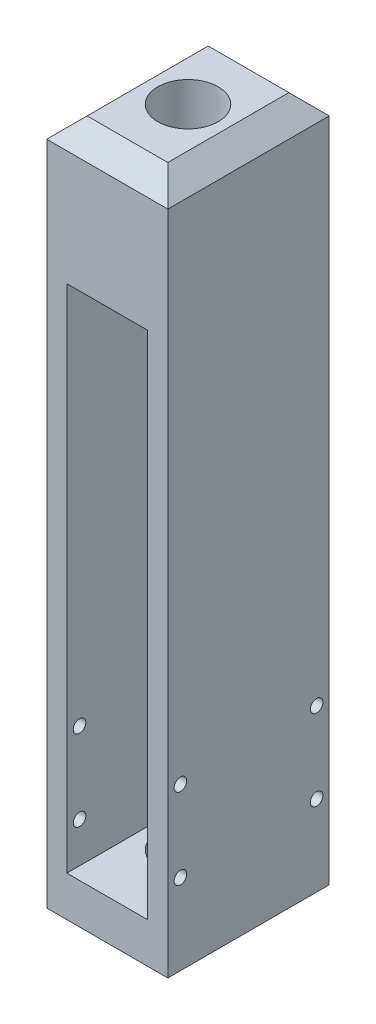
ISO-10303-21;
HEADER;
FILE_DESCRIPTION(('STEP AP214'),'2;1');
FILE_NAME('part.step','',(''),(''),'','','');
FILE_SCHEMA(('AUTOMOTIVE_DESIGN { 1 0 10303 214 1 1 1 1 }'));
ENDSEC;
DATA;
#1=APPLICATION_CONTEXT('core data for automotive mechanical design processes');
#2=APPLICATION_PROTOCOL_DEFINITION('international standard','automotive_design',2000,#1);
#3=PRODUCT_CONTEXT('',#1,'mechanical');
#4=PRODUCT('Part','Part','',(#3));
#5=PRODUCT_RELATED_PRODUCT_CATEGORY('part','',(#4));
#6=PRODUCT_DEFINITION_FORMATION('','',#4);
#7=PRODUCT_DEFINITION_CONTEXT('part definition',#1,'design');
#8=PRODUCT_DEFINITION('design','',#6,#7);
#9=PRODUCT_DEFINITION_SHAPE('','',#8);
#10=(LENGTH_UNIT() NAMED_UNIT(*) SI_UNIT(.MILLI.,.METRE.));
#11=(NAMED_UNIT(*) PLANE_ANGLE_UNIT() SI_UNIT($,.RADIAN.));
#12=(NAMED_UNIT(*) SI_UNIT($,.STERADIAN.) SOLID_ANGLE_UNIT());
#13=UNCERTAINTY_MEASURE_WITH_UNIT(LENGTH_MEASURE(1.E-05),#10,'distance_accuracy_value','');
#14=(GEOMETRIC_REPRESENTATION_CONTEXT(3) GLOBAL_UNCERTAINTY_ASSIGNED_CONTEXT((#13)) GLOBAL_UNIT_ASSIGNED_CONTEXT((#10,
#11,#12)) REPRESENTATION_CONTEXT('',''));
#15=CARTESIAN_POINT('',(0.,0.,0.));
#16=DIRECTION('',(0.,0.,1.));
#17=DIRECTION('',(1.,0.,0.));
#18=AXIS2_PLACEMENT_3D('',#15,#16,#17);
#19=CARTESIAN_POINT('',(38.1,0.,50.8));
#20=DIRECTION('',(-1.,0.,0.));
#21=DIRECTION('',(0.,0.,1.));
#22=AXIS2_PLACEMENT_3D('',#19,#20,#21);
#23=PLANE('',#22);
#24=CARTESIAN_POINT('',(38.1,25.4,3.96875));
#25=DIRECTION('',(1.,0.,0.));
#26=DIRECTION('',(0.,0.,-1.));
#27=AXIS2_PLACEMENT_3D('',#24,#25,#26);
#28=CIRCLE('',#27,1.984375);
#29=CARTESIAN_POINT('',(38.1,25.4,1.984375));
#30=VERTEX_POINT('',#29);
#31=EDGE_CURVE('E234',#30,#30,#28,.T.);
#32=ORIENTED_EDGE('',*,*,#31,.F.);
#33=EDGE_LOOP('',(#32));
#34=FACE_BOUND('',#33,.T.);
#35=CARTESIAN_POINT('',(38.1,50.8,3.96875));
#36=DIRECTION('',(1.,0.,0.));
#37=DIRECTION('',(0.,0.,-1.));
#38=AXIS2_PLACEMENT_3D('',#35,#36,#37);
#39=CIRCLE('',#38,1.984375);
#40=CARTESIAN_POINT('',(38.1,50.8,1.984375));
#41=VERTEX_POINT('',#40);
#42=EDGE_CURVE('E240',#41,#41,#39,.T.);
#43=ORIENTED_EDGE('',*,*,#42,.F.);
#44=EDGE_LOOP('',(#43));
#45=FACE_BOUND('',#44,.T.);
#46=CARTESIAN_POINT('',(38.1,50.8,46.83125));
#47=DIRECTION('',(1.,0.,0.));
#48=DIRECTION('',(0.,0.,-1.));
#49=AXIS2_PLACEMENT_3D('',#46,#47,#48);
#50=CIRCLE('',#49,1.984375);
#51=CARTESIAN_POINT('',(38.1,50.8,44.846875));
#52=VERTEX_POINT('',#51);
#53=EDGE_CURVE('E246',#52,#52,#50,.T.);
#54=ORIENTED_EDGE('',*,*,#53,.F.);
#55=EDGE_LOOP('',(#54));
#56=FACE_BOUND('',#55,.T.);
#57=DIRECTION('',(0.,1.,0.));
#58=VECTOR('',#57,1.);
#59=CARTESIAN_POINT('',(38.1,0.,0.));
#60=LINE('',#59,#58);
#61=CARTESIAN_POINT('',(38.1,0.,0.));
#62=VERTEX_POINT('',#61);
#63=CARTESIAN_POINT('',(38.1,209.55,0.));
#64=VERTEX_POINT('',#63);
#65=EDGE_CURVE('E159',#62,#64,#60,.T.);
#66=ORIENTED_EDGE('',*,*,#65,.T.);
#67=DIRECTION('',(0.,0.,1.));
#68=VECTOR('',#67,1.);
#69=CARTESIAN_POINT('',(38.1,209.55,50.8));
#70=LINE('',#69,#68);
#71=CARTESIAN_POINT('',(38.1,209.55,50.8));
#72=VERTEX_POINT('',#71);
#73=EDGE_CURVE('E42',#64,#72,#70,.T.);
#74=ORIENTED_EDGE('',*,*,#73,.T.);
#75=DIRECTION('',(0.,1.,0.));
#76=VECTOR('',#75,1.);
#77=CARTESIAN_POINT('',(38.1,0.,50.8));
#78=LINE('',#77,#76);
#79=CARTESIAN_POINT('',(38.1,0.,50.8));
#80=VERTEX_POINT('',#79);
#81=EDGE_CURVE('E161',#80,#72,#78,.T.);
#82=ORIENTED_EDGE('',*,*,#81,.F.);
#83=DIRECTION('',(0.,0.,-1.));
#84=VECTOR('',#83,1.);
#85=CARTESIAN_POINT('',(38.1,0.,50.8));
#86=LINE('',#85,#84);
#87=EDGE_CURVE('E163',#80,#62,#86,.T.);
#88=ORIENTED_EDGE('',*,*,#87,.T.);
#89=EDGE_LOOP('',(#66,#74,#82,#88));
#90=FACE_BOUND('',#89,.T.);
#91=CARTESIAN_POINT('',(38.1,25.4,46.83125));
#92=DIRECTION('',(1.,0.,0.));
#93=DIRECTION('',(0.,0.,-1.));
#94=AXIS2_PLACEMENT_3D('',#91,#92,#93);
#95=CIRCLE('',#94,1.984375);
#96=CARTESIAN_POINT('',(38.1,25.4,44.846875));
#97=VERTEX_POINT('',#96);
#98=EDGE_CURVE('E228',#97,#97,#95,.T.);
#99=ORIENTED_EDGE('',*,*,#98,.F.);
#100=EDGE_LOOP('',(#99));
#101=FACE_BOUND('',#100,.T.);
#102=ADVANCED_FACE('F33',(#34,#45,#56,#90,#101),#23,.F.);
#103=CARTESIAN_POINT('',(0.,0.,50.8));
#104=DIRECTION('',(0.,0.,-1.));
#105=DIRECTION('',(-1.,0.,0.));
#106=AXIS2_PLACEMENT_3D('',#103,#104,#105);
#107=PLANE('',#106);
#108=ORIENTED_EDGE('',*,*,#81,.T.);
#109=DIRECTION('',(-1.,0.,0.));
#110=VECTOR('',#109,1.);
#111=CARTESIAN_POINT('',(0.,209.55,50.8));
#112=LINE('',#111,#110);
#113=CARTESIAN_POINT('',(0.,209.55,50.8));
#114=VERTEX_POINT('',#113);
#115=EDGE_CURVE('E11',#72,#114,#112,.T.);
#116=ORIENTED_EDGE('',*,*,#115,.T.);
#117=DIRECTION('',(0.,-1.,0.));
#118=VECTOR('',#117,1.);
#119=CARTESIAN_POINT('',(0.,0.,50.8));
#120=LINE('',#119,#118);
#121=CARTESIAN_POINT('',(0.,0.,50.8));
#122=VERTEX_POINT('',#121);
#123=EDGE_CURVE('E156',#114,#122,#120,.T.);
#124=ORIENTED_EDGE('',*,*,#123,.T.);
#125=DIRECTION('',(1.,0.,0.));
#126=VECTOR('',#125,1.);
#127=CARTESIAN_POINT('',(0.,0.,50.8));
#128=LINE('',#127,#126);
#129=EDGE_CURVE('E158',#122,#80,#128,.T.);
#130=ORIENTED_EDGE('',*,*,#129,.T.);
#131=EDGE_LOOP('',(#108,#116,#124,#130));
#132=FACE_BOUND('',#131,.T.);
#133=DIRECTION('',(0.,-1.,0.));
#134=VECTOR('',#133,1.);
#135=CARTESIAN_POINT('',(6.35,12.7,50.8));
#136=LINE('',#135,#134);
#137=CARTESIAN_POINT('',(6.35,173.355,50.8));
#138=VERTEX_POINT('',#137);
#139=CARTESIAN_POINT('',(6.35,12.7,50.8));
#140=VERTEX_POINT('',#139);
#141=EDGE_CURVE('E112',#138,#140,#136,.T.);
#142=ORIENTED_EDGE('',*,*,#141,.F.);
#143=DIRECTION('',(-1.,0.,0.));
#144=VECTOR('',#143,1.);
#145=CARTESIAN_POINT('',(6.35,173.355,50.8));
#146=LINE('',#145,#144);
#147=CARTESIAN_POINT('',(31.75,173.355,50.8));
#148=VERTEX_POINT('',#147);
#149=EDGE_CURVE('E138',#148,#138,#146,.T.);
#150=ORIENTED_EDGE('',*,*,#149,.F.);
#151=DIRECTION('',(0.,1.,0.));
#152=VECTOR('',#151,1.);
#153=CARTESIAN_POINT('',(31.75,12.7,50.8));
#154=LINE('',#153,#152);
#155=CARTESIAN_POINT('',(31.75,12.7,50.8));
#156=VERTEX_POINT('',#155);
#157=EDGE_CURVE('E136',#156,#148,#154,.T.);
#158=ORIENTED_EDGE('',*,*,#157,.F.);
#159=DIRECTION('',(1.,0.,0.));
#160=VECTOR('',#159,1.);
#161=CARTESIAN_POINT('',(6.35,12.7,50.8));
#162=LINE('',#161,#160);
#163=EDGE_CURVE('E122',#140,#156,#162,.T.);
#164=ORIENTED_EDGE('',*,*,#163,.F.);
#165=EDGE_LOOP('',(#142,#150,#158,#164));
#166=FACE_BOUND('',#165,.T.);
#167=ADVANCED_FACE('F134',(#132,#166),#107,.F.);
#168=CARTESIAN_POINT('',(0.,0.,0.));
#169=DIRECTION('',(0.,0.,-1.));
#170=DIRECTION('',(-1.,0.,0.));
#171=AXIS2_PLACEMENT_3D('',#168,#169,#170);
#172=PLANE('',#171);
#173=DIRECTION('',(0.,-1.,0.));
#174=VECTOR('',#173,1.);
#175=CARTESIAN_POINT('',(0.,0.,0.));
#176=LINE('',#175,#174);
#177=CARTESIAN_POINT('',(0.,209.55,0.));
#178=VERTEX_POINT('',#177);
#179=CARTESIAN_POINT('',(0.,0.,0.));
#180=VERTEX_POINT('',#179);
#181=EDGE_CURVE('E130',#178,#180,#176,.T.);
#182=ORIENTED_EDGE('',*,*,#181,.F.);
#183=DIRECTION('',(1.,0.,0.));
#184=VECTOR('',#183,1.);
#185=CARTESIAN_POINT('',(38.1,209.55,0.));
#186=LINE('',#185,#184);
#187=EDGE_CURVE('E182',#178,#64,#186,.T.);
#188=ORIENTED_EDGE('',*,*,#187,.T.);
#189=ORIENTED_EDGE('',*,*,#65,.F.);
#190=DIRECTION('',(1.,0.,0.));
#191=VECTOR('',#190,1.);
#192=CARTESIAN_POINT('',(0.,0.,0.));
#193=LINE('',#192,#191);
#194=EDGE_CURVE('E165',#180,#62,#193,.T.);
#195=ORIENTED_EDGE('',*,*,#194,.F.);
#196=EDGE_LOOP('',(#182,#188,#189,#195));
#197=FACE_BOUND('',#196,.T.);
#198=DIRECTION('',(-1.,0.,0.));
#199=VECTOR('',#198,1.);
#200=CARTESIAN_POINT('',(6.35,173.355,0.));
#201=LINE('',#200,#199);
#202=CARTESIAN_POINT('',(31.75,173.355,0.));
#203=VERTEX_POINT('',#202);
#204=CARTESIAN_POINT('',(6.35,173.355,0.));
#205=VERTEX_POINT('',#204);
#206=EDGE_CURVE('E123',#203,#205,#201,.T.);
#207=ORIENTED_EDGE('',*,*,#206,.T.);
#208=DIRECTION('',(0.,-1.,0.));
#209=VECTOR('',#208,1.);
#210=CARTESIAN_POINT('',(6.35,12.7,0.));
#211=LINE('',#210,#209);
#212=CARTESIAN_POINT('',(6.35,12.7,0.));
#213=VERTEX_POINT('',#212);
#214=EDGE_CURVE('E143',#205,#213,#211,.T.);
#215=ORIENTED_EDGE('',*,*,#214,.T.);
#216=DIRECTION('',(1.,0.,0.));
#217=VECTOR('',#216,1.);
#218=CARTESIAN_POINT('',(6.35,12.7,0.));
#219=LINE('',#218,#217);
#220=CARTESIAN_POINT('',(31.75,12.7,0.));
#221=VERTEX_POINT('',#220);
#222=EDGE_CURVE('E129',#213,#221,#219,.T.);
#223=ORIENTED_EDGE('',*,*,#222,.T.);
#224=DIRECTION('',(0.,1.,0.));
#225=VECTOR('',#224,1.);
#226=CARTESIAN_POINT('',(31.75,12.7,0.));
#227=LINE('',#226,#225);
#228=EDGE_CURVE('E147',#221,#203,#227,.T.);
#229=ORIENTED_EDGE('',*,*,#228,.T.);
#230=EDGE_LOOP('',(#207,#215,#223,#229));
#231=FACE_BOUND('',#230,.T.);
#232=ADVANCED_FACE('F284',(#197,#231),#172,.T.);
#233=CARTESIAN_POINT('',(0.,0.,50.8));
#234=DIRECTION('',(1.,0.,0.));
#235=DIRECTION('',(0.,0.,-1.));
#236=AXIS2_PLACEMENT_3D('',#233,#234,#235);
#237=PLANE('',#236);
#238=CARTESIAN_POINT('',(0.,25.4,46.83125));
#239=DIRECTION('',(-1.,0.,0.));
#240=DIRECTION('',(0.,0.,1.));
#241=AXIS2_PLACEMENT_3D('',#238,#239,#240);
#242=CIRCLE('',#241,1.984375);
#243=CARTESIAN_POINT('',(0.,25.4,48.815625));
#244=VERTEX_POINT('',#243);
#245=EDGE_CURVE('E198',#244,#244,#242,.T.);
#246=ORIENTED_EDGE('',*,*,#245,.F.);
#247=EDGE_LOOP('',(#246));
#248=FACE_BOUND('',#247,.T.);
#249=CARTESIAN_POINT('',(0.,25.4,3.96875));
#250=DIRECTION('',(-1.,0.,0.));
#251=DIRECTION('',(0.,0.,1.));
#252=AXIS2_PLACEMENT_3D('',#249,#250,#251);
#253=CIRCLE('',#252,1.984375);
#254=CARTESIAN_POINT('',(0.,25.4,5.953125));
#255=VERTEX_POINT('',#254);
#256=EDGE_CURVE('E208',#255,#255,#253,.T.);
#257=ORIENTED_EDGE('',*,*,#256,.F.);
#258=EDGE_LOOP('',(#257));
#259=FACE_BOUND('',#258,.T.);
#260=CARTESIAN_POINT('',(0.,50.8,3.96875));
#261=DIRECTION('',(-1.,0.,0.));
#262=DIRECTION('',(0.,0.,1.));
#263=AXIS2_PLACEMENT_3D('',#260,#261,#262);
#264=CIRCLE('',#263,1.984375);
#265=CARTESIAN_POINT('',(0.,50.8,5.953125));
#266=VERTEX_POINT('',#265);
#267=EDGE_CURVE('E216',#266,#266,#264,.T.);
#268=ORIENTED_EDGE('',*,*,#267,.F.);
#269=EDGE_LOOP('',(#268));
#270=FACE_BOUND('',#269,.T.);
#271=CARTESIAN_POINT('',(0.,50.8,46.83125));
#272=DIRECTION('',(-1.,0.,0.));
#273=DIRECTION('',(0.,0.,1.));
#274=AXIS2_PLACEMENT_3D('',#271,#272,#273);
#275=CIRCLE('',#274,1.984375);
#276=CARTESIAN_POINT('',(0.,50.8,48.815625));
#277=VERTEX_POINT('',#276);
#278=EDGE_CURVE('E222',#277,#277,#275,.T.);
#279=ORIENTED_EDGE('',*,*,#278,.F.);
#280=EDGE_LOOP('',(#279));
#281=FACE_BOUND('',#280,.T.);
#282=ORIENTED_EDGE('',*,*,#123,.F.);
#283=DIRECTION('',(0.,0.,-1.));
#284=VECTOR('',#283,1.);
#285=CARTESIAN_POINT('',(0.,209.55,50.8));
#286=LINE('',#285,#284);
#287=EDGE_CURVE('E185',#114,#178,#286,.T.);
#288=ORIENTED_EDGE('',*,*,#287,.T.);
#289=ORIENTED_EDGE('',*,*,#181,.T.);
#290=DIRECTION('',(0.,0.,-1.));
#291=VECTOR('',#290,1.);
#292=CARTESIAN_POINT('',(0.,0.,50.8));
#293=LINE('',#292,#291);
#294=EDGE_CURVE('E170',#122,#180,#293,.T.);
#295=ORIENTED_EDGE('',*,*,#294,.F.);
#296=EDGE_LOOP('',(#282,#288,#289,#295));
#297=FACE_BOUND('',#296,.T.);
#298=ADVANCED_FACE('F294',(#248,#259,#270,#281,#297),#237,.F.);
#299=CARTESIAN_POINT('',(0.,0.,50.8));
#300=DIRECTION('',(0.,1.,0.));
#301=DIRECTION('',(0.,0.,1.));
#302=AXIS2_PLACEMENT_3D('',#299,#300,#301);
#303=PLANE('',#302);
#304=CARTESIAN_POINT('',(19.05,0.,25.4));
#305=DIRECTION('',(0.,-1.,0.));
#306=DIRECTION('',(0.,0.,-1.));
#307=AXIS2_PLACEMENT_3D('',#304,#305,#306);
#308=CIRCLE('',#307,9.525);
#309=CARTESIAN_POINT('',(19.05,0.,15.875));
#310=VERTEX_POINT('',#309);
#311=EDGE_CURVE('E258',#310,#310,#308,.T.);
#312=ORIENTED_EDGE('',*,*,#311,.F.);
#313=EDGE_LOOP('',(#312));
#314=FACE_BOUND('',#313,.T.);
#315=ORIENTED_EDGE('',*,*,#194,.T.);
#316=ORIENTED_EDGE('',*,*,#87,.F.);
#317=ORIENTED_EDGE('',*,*,#129,.F.);
#318=ORIENTED_EDGE('',*,*,#294,.T.);
#319=EDGE_LOOP('',(#315,#316,#317,#318));
#320=FACE_BOUND('',#319,.T.);
#321=ADVANCED_FACE('F291',(#314,#320),#303,.F.);
#322=CARTESIAN_POINT('',(0.,215.9,50.8));
#323=DIRECTION('',(0.,-1.,0.));
#324=DIRECTION('',(0.,0.,-1.));
#325=AXIS2_PLACEMENT_3D('',#322,#323,#324);
#326=PLANE('',#325);
#327=DIRECTION('',(0.,0.,-1.));
#328=VECTOR('',#327,1.);
#329=CARTESIAN_POINT('',(31.7499999999999,215.9,50.8));
#330=LINE('',#329,#328);
#331=CARTESIAN_POINT('',(31.7499999999999,215.9,44.4499999999999));
#332=VERTEX_POINT('',#331);
#333=CARTESIAN_POINT('',(31.7499999999999,215.9,6.35000000000008));
#334=VERTEX_POINT('',#333);
#335=EDGE_CURVE('E175',#332,#334,#330,.T.);
#336=ORIENTED_EDGE('',*,*,#335,.T.);
#337=DIRECTION('',(-1.,0.,0.));
#338=VECTOR('',#337,1.);
#339=CARTESIAN_POINT('',(0.,215.9,6.35000000000008));
#340=LINE('',#339,#338);
#341=CARTESIAN_POINT('',(6.35000000000008,215.9,6.35000000000008));
#342=VERTEX_POINT('',#341);
#343=EDGE_CURVE('E179',#334,#342,#340,.T.);
#344=ORIENTED_EDGE('',*,*,#343,.T.);
#345=DIRECTION('',(0.,0.,1.));
#346=VECTOR('',#345,1.);
#347=CARTESIAN_POINT('',(6.35000000000008,215.9,50.8));
#348=LINE('',#347,#346);
#349=CARTESIAN_POINT('',(6.35000000000008,215.9,44.4499999999999));
#350=VERTEX_POINT('',#349);
#351=EDGE_CURVE('E177',#342,#350,#348,.T.);
#352=ORIENTED_EDGE('',*,*,#351,.T.);
#353=DIRECTION('',(1.,0.,0.));
#354=VECTOR('',#353,1.);
#355=CARTESIAN_POINT('',(0.,215.9,44.4499999999999));
#356=LINE('',#355,#354);
#357=EDGE_CURVE('E173',#350,#332,#356,.T.);
#358=ORIENTED_EDGE('',*,*,#357,.T.);
#359=EDGE_LOOP('',(#336,#344,#352,#358));
#360=FACE_BOUND('',#359,.T.);
#361=CARTESIAN_POINT('',(19.05,215.9,25.4));
#362=DIRECTION('',(0.,1.,0.));
#363=DIRECTION('',(0.,0.,1.));
#364=AXIS2_PLACEMENT_3D('',#361,#362,#363);
#365=CIRCLE('',#364,9.52499999999999);
#366=CARTESIAN_POINT('',(19.05,215.9,34.925));
#367=VERTEX_POINT('',#366);
#368=EDGE_CURVE('E252',#367,#367,#365,.T.);
#369=ORIENTED_EDGE('',*,*,#368,.F.);
#370=EDGE_LOOP('',(#369));
#371=FACE_BOUND('',#370,.T.);
#372=ADVANCED_FACE('F275',(#360,#371),#326,.F.);
#373=CARTESIAN_POINT('',(6.35,12.7,50.8));
#374=DIRECTION('',(1.,0.,0.));
#375=DIRECTION('',(0.,0.,-1.));
#376=AXIS2_PLACEMENT_3D('',#373,#374,#375);
#377=PLANE('',#376);
#378=CARTESIAN_POINT('',(6.35,25.4,46.83125));
#379=DIRECTION('',(1.,0.,0.));
#380=DIRECTION('',(0.,0.,-1.));
#381=AXIS2_PLACEMENT_3D('',#378,#379,#380);
#382=CIRCLE('',#381,1.984375);
#383=CARTESIAN_POINT('',(6.35,25.4,44.846875));
#384=VERTEX_POINT('',#383);
#385=EDGE_CURVE('E203',#384,#384,#382,.T.);
#386=ORIENTED_EDGE('',*,*,#385,.F.);
#387=EDGE_LOOP('',(#386));
#388=FACE_BOUND('',#387,.T.);
#389=CARTESIAN_POINT('',(6.35,25.4,3.96875));
#390=DIRECTION('',(1.,0.,0.));
#391=DIRECTION('',(0.,0.,-1.));
#392=AXIS2_PLACEMENT_3D('',#389,#390,#391);
#393=CIRCLE('',#392,1.984375);
#394=CARTESIAN_POINT('',(6.35,25.4,1.984375));
#395=VERTEX_POINT('',#394);
#396=EDGE_CURVE('E213',#395,#395,#393,.T.);
#397=ORIENTED_EDGE('',*,*,#396,.F.);
#398=EDGE_LOOP('',(#397));
#399=FACE_BOUND('',#398,.T.);
#400=CARTESIAN_POINT('',(6.35,50.8,3.96875));
#401=DIRECTION('',(1.,0.,0.));
#402=DIRECTION('',(0.,0.,-1.));
#403=AXIS2_PLACEMENT_3D('',#400,#401,#402);
#404=CIRCLE('',#403,1.984375);
#405=CARTESIAN_POINT('',(6.35,50.8,1.984375));
#406=VERTEX_POINT('',#405);
#407=EDGE_CURVE('E219',#406,#406,#404,.T.);
#408=ORIENTED_EDGE('',*,*,#407,.F.);
#409=EDGE_LOOP('',(#408));
#410=FACE_BOUND('',#409,.T.);
#411=CARTESIAN_POINT('',(6.35,50.8,46.83125));
#412=DIRECTION('',(1.,0.,0.));
#413=DIRECTION('',(0.,0.,-1.));
#414=AXIS2_PLACEMENT_3D('',#411,#412,#413);
#415=CIRCLE('',#414,1.984375);
#416=CARTESIAN_POINT('',(6.35,50.8,44.846875));
#417=VERTEX_POINT('',#416);
#418=EDGE_CURVE('E225',#417,#417,#415,.T.);
#419=ORIENTED_EDGE('',*,*,#418,.F.);
#420=EDGE_LOOP('',(#419));
#421=FACE_BOUND('',#420,.T.);
#422=ORIENTED_EDGE('',*,*,#214,.F.);
#423=DIRECTION('',(0.,0.,-1.));
#424=VECTOR('',#423,1.);
#425=CARTESIAN_POINT('',(6.35,173.355,50.8));
#426=LINE('',#425,#424);
#427=EDGE_CURVE('E118',#138,#205,#426,.T.);
#428=ORIENTED_EDGE('',*,*,#427,.F.);
#429=ORIENTED_EDGE('',*,*,#141,.T.);
#430=DIRECTION('',(0.,0.,-1.));
#431=VECTOR('',#430,1.);
#432=CARTESIAN_POINT('',(6.35,12.7,50.8));
#433=LINE('',#432,#431);
#434=EDGE_CURVE('E115',#140,#213,#433,.T.);
#435=ORIENTED_EDGE('',*,*,#434,.T.);
#436=EDGE_LOOP('',(#422,#428,#429,#435));
#437=FACE_BOUND('',#436,.T.);
#438=ADVANCED_FACE('F114',(#388,#399,#410,#421,#437),#377,.T.);
#439=CARTESIAN_POINT('',(6.35,12.7,50.8));
#440=DIRECTION('',(0.,1.,0.));
#441=DIRECTION('',(0.,0.,1.));
#442=AXIS2_PLACEMENT_3D('',#439,#440,#441);
#443=PLANE('',#442);
#444=CARTESIAN_POINT('',(19.05,12.7,25.4));
#445=DIRECTION('',(0.,1.,0.));
#446=DIRECTION('',(0.,0.,1.));
#447=AXIS2_PLACEMENT_3D('',#444,#445,#446);
#448=CIRCLE('',#447,9.525);
#449=CARTESIAN_POINT('',(19.05,12.7,34.925));
#450=VERTEX_POINT('',#449);
#451=EDGE_CURVE('E145',#450,#450,#448,.T.);
#452=ORIENTED_EDGE('',*,*,#451,.F.);
#453=EDGE_LOOP('',(#452));
#454=FACE_BOUND('',#453,.T.);
#455=ORIENTED_EDGE('',*,*,#222,.F.);
#456=ORIENTED_EDGE('',*,*,#434,.F.);
#457=ORIENTED_EDGE('',*,*,#163,.T.);
#458=DIRECTION('',(0.,0.,-1.));
#459=VECTOR('',#458,1.);
#460=CARTESIAN_POINT('',(31.75,12.7,50.8));
#461=LINE('',#460,#459);
#462=EDGE_CURVE('E131',#156,#221,#461,.T.);
#463=ORIENTED_EDGE('',*,*,#462,.T.);
#464=EDGE_LOOP('',(#455,#456,#457,#463));
#465=FACE_BOUND('',#464,.T.);
#466=ADVANCED_FACE('F126',(#454,#465),#443,.T.);
#467=CARTESIAN_POINT('',(31.75,12.7,50.8));
#468=DIRECTION('',(-1.,0.,0.));
#469=DIRECTION('',(0.,0.,1.));
#470=AXIS2_PLACEMENT_3D('',#467,#468,#469);
#471=PLANE('',#470);
#472=CARTESIAN_POINT('',(31.75,25.4,46.83125));
#473=DIRECTION('',(-1.,0.,0.));
#474=DIRECTION('',(0.,0.,1.));
#475=AXIS2_PLACEMENT_3D('',#472,#473,#474);
#476=CIRCLE('',#475,1.984375);
#477=CARTESIAN_POINT('',(31.75,25.4,48.815625));
#478=VERTEX_POINT('',#477);
#479=EDGE_CURVE('E231',#478,#478,#476,.T.);
#480=ORIENTED_EDGE('',*,*,#479,.F.);
#481=EDGE_LOOP('',(#480));
#482=FACE_BOUND('',#481,.T.);
#483=CARTESIAN_POINT('',(31.75,25.4,3.96875));
#484=DIRECTION('',(-1.,0.,0.));
#485=DIRECTION('',(0.,0.,1.));
#486=AXIS2_PLACEMENT_3D('',#483,#484,#485);
#487=CIRCLE('',#486,1.984375);
#488=CARTESIAN_POINT('',(31.75,25.4,5.953125));
#489=VERTEX_POINT('',#488);
#490=EDGE_CURVE('E237',#489,#489,#487,.T.);
#491=ORIENTED_EDGE('',*,*,#490,.F.);
#492=EDGE_LOOP('',(#491));
#493=FACE_BOUND('',#492,.T.);
#494=CARTESIAN_POINT('',(31.75,50.8,3.96875));
#495=DIRECTION('',(-1.,0.,0.));
#496=DIRECTION('',(0.,0.,1.));
#497=AXIS2_PLACEMENT_3D('',#494,#495,#496);
#498=CIRCLE('',#497,1.984375);
#499=CARTESIAN_POINT('',(31.75,50.8,5.953125));
#500=VERTEX_POINT('',#499);
#501=EDGE_CURVE('E243',#500,#500,#498,.T.);
#502=ORIENTED_EDGE('',*,*,#501,.F.);
#503=EDGE_LOOP('',(#502));
#504=FACE_BOUND('',#503,.T.);
#505=CARTESIAN_POINT('',(31.75,50.8,46.83125));
#506=DIRECTION('',(-1.,0.,0.));
#507=DIRECTION('',(0.,0.,1.));
#508=AXIS2_PLACEMENT_3D('',#505,#506,#507);
#509=CIRCLE('',#508,1.984375);
#510=CARTESIAN_POINT('',(31.75,50.8,48.815625));
#511=VERTEX_POINT('',#510);
#512=EDGE_CURVE('E249',#511,#511,#509,.T.);
#513=ORIENTED_EDGE('',*,*,#512,.F.);
#514=EDGE_LOOP('',(#513));
#515=FACE_BOUND('',#514,.T.);
#516=ORIENTED_EDGE('',*,*,#228,.F.);
#517=ORIENTED_EDGE('',*,*,#462,.F.);
#518=ORIENTED_EDGE('',*,*,#157,.T.);
#519=DIRECTION('',(0.,0.,-1.));
#520=VECTOR('',#519,1.);
#521=CARTESIAN_POINT('',(31.75,173.355,50.8));
#522=LINE('',#521,#520);
#523=EDGE_CURVE('E153',#148,#203,#522,.T.);
#524=ORIENTED_EDGE('',*,*,#523,.T.);
#525=EDGE_LOOP('',(#516,#517,#518,#524));
#526=FACE_BOUND('',#525,.T.);
#527=ADVANCED_FACE('F266',(#482,#493,#504,#515,#526),#471,.T.);
#528=CARTESIAN_POINT('',(6.35,173.355,50.8));
#529=DIRECTION('',(0.,-1.,0.));
#530=DIRECTION('',(0.,0.,-1.));
#531=AXIS2_PLACEMENT_3D('',#528,#529,#530);
#532=PLANE('',#531);
#533=CARTESIAN_POINT('',(19.05,173.355,25.4));
#534=DIRECTION('',(0.,-1.,0.));
#535=DIRECTION('',(0.,0.,-1.));
#536=AXIS2_PLACEMENT_3D('',#533,#534,#535);
#537=CIRCLE('',#536,9.52499999999999);
#538=CARTESIAN_POINT('',(19.05,173.355,15.875));
#539=VERTEX_POINT('',#538);
#540=EDGE_CURVE('E255',#539,#539,#537,.T.);
#541=ORIENTED_EDGE('',*,*,#540,.F.);
#542=EDGE_LOOP('',(#541));
#543=FACE_BOUND('',#542,.T.);
#544=ORIENTED_EDGE('',*,*,#206,.F.);
#545=ORIENTED_EDGE('',*,*,#523,.F.);
#546=ORIENTED_EDGE('',*,*,#149,.T.);
#547=ORIENTED_EDGE('',*,*,#427,.T.);
#548=EDGE_LOOP('',(#544,#545,#546,#547));
#549=FACE_BOUND('',#548,.T.);
#550=ADVANCED_FACE('F272',(#543,#549),#532,.T.);
#551=CARTESIAN_POINT('',(19.05,0.,25.4));
#552=DIRECTION('',(0.,-1.,0.));
#553=DIRECTION('',(0.,0.,-1.));
#554=AXIS2_PLACEMENT_3D('',#551,#552,#553);
#555=CYLINDRICAL_SURFACE('',#554,9.525);
#556=ORIENTED_EDGE('',*,*,#311,.T.);
#557=EDGE_LOOP('',(#556));
#558=FACE_BOUND('',#557,.T.);
#559=ORIENTED_EDGE('',*,*,#451,.T.);
#560=EDGE_LOOP('',(#559));
#561=FACE_BOUND('',#560,.T.);
#562=ADVANCED_FACE('F263',(#558,#561),#555,.F.);
#563=CARTESIAN_POINT('',(19.05,215.9,25.4));
#564=DIRECTION('',(0.,1.,0.));
#565=DIRECTION('',(0.,0.,1.));
#566=AXIS2_PLACEMENT_3D('',#563,#564,#565);
#567=CYLINDRICAL_SURFACE('',#566,9.52499999999999);
#568=ORIENTED_EDGE('',*,*,#368,.T.);
#569=EDGE_LOOP('',(#568));
#570=FACE_BOUND('',#569,.T.);
#571=ORIENTED_EDGE('',*,*,#540,.T.);
#572=EDGE_LOOP('',(#571));
#573=FACE_BOUND('',#572,.T.);
#574=ADVANCED_FACE('F334',(#570,#573),#567,.F.);
#575=CARTESIAN_POINT('',(38.1,50.8,46.83125));
#576=DIRECTION('',(1.,0.,0.));
#577=DIRECTION('',(0.,0.,-1.));
#578=AXIS2_PLACEMENT_3D('',#575,#576,#577);
#579=CYLINDRICAL_SURFACE('',#578,1.984375);
#580=ORIENTED_EDGE('',*,*,#53,.T.);
#581=EDGE_LOOP('',(#580));
#582=FACE_BOUND('',#581,.T.);
#583=ORIENTED_EDGE('',*,*,#512,.T.);
#584=EDGE_LOOP('',(#583));
#585=FACE_BOUND('',#584,.T.);
#586=ADVANCED_FACE('F337',(#582,#585),#579,.F.);
#587=CARTESIAN_POINT('',(38.1,50.8,3.96875));
#588=DIRECTION('',(1.,0.,0.));
#589=DIRECTION('',(0.,0.,-1.));
#590=AXIS2_PLACEMENT_3D('',#587,#588,#589);
#591=CYLINDRICAL_SURFACE('',#590,1.984375);
#592=ORIENTED_EDGE('',*,*,#42,.T.);
#593=EDGE_LOOP('',(#592));
#594=FACE_BOUND('',#593,.T.);
#595=ORIENTED_EDGE('',*,*,#501,.T.);
#596=EDGE_LOOP('',(#595));
#597=FACE_BOUND('',#596,.T.);
#598=ADVANCED_FACE('F442',(#594,#597),#591,.F.);
#599=CARTESIAN_POINT('',(38.1,25.4,3.96875));
#600=DIRECTION('',(1.,0.,0.));
#601=DIRECTION('',(0.,0.,-1.));
#602=AXIS2_PLACEMENT_3D('',#599,#600,#601);
#603=CYLINDRICAL_SURFACE('',#602,1.984375);
#604=ORIENTED_EDGE('',*,*,#31,.T.);
#605=EDGE_LOOP('',(#604));
#606=FACE_BOUND('',#605,.T.);
#607=ORIENTED_EDGE('',*,*,#490,.T.);
#608=EDGE_LOOP('',(#607));
#609=FACE_BOUND('',#608,.T.);
#610=ADVANCED_FACE('F452',(#606,#609),#603,.F.);
#611=CARTESIAN_POINT('',(38.1,25.4,46.83125));
#612=DIRECTION('',(1.,0.,0.));
#613=DIRECTION('',(0.,0.,-1.));
#614=AXIS2_PLACEMENT_3D('',#611,#612,#613);
#615=CYLINDRICAL_SURFACE('',#614,1.984375);
#616=ORIENTED_EDGE('',*,*,#98,.T.);
#617=EDGE_LOOP('',(#616));
#618=FACE_BOUND('',#617,.T.);
#619=ORIENTED_EDGE('',*,*,#479,.T.);
#620=EDGE_LOOP('',(#619));
#621=FACE_BOUND('',#620,.T.);
#622=ADVANCED_FACE('F375',(#618,#621),#615,.F.);
#623=CARTESIAN_POINT('',(0.,50.8,46.83125));
#624=DIRECTION('',(-1.,0.,0.));
#625=DIRECTION('',(0.,0.,1.));
#626=AXIS2_PLACEMENT_3D('',#623,#624,#625);
#627=CYLINDRICAL_SURFACE('',#626,1.984375);
#628=ORIENTED_EDGE('',*,*,#278,.T.);
#629=EDGE_LOOP('',(#628));
#630=FACE_BOUND('',#629,.T.);
#631=ORIENTED_EDGE('',*,*,#418,.T.);
#632=EDGE_LOOP('',(#631));
#633=FACE_BOUND('',#632,.T.);
#634=ADVANCED_FACE('F380',(#630,#633),#627,.F.);
#635=CARTESIAN_POINT('',(0.,50.8,3.96875));
#636=DIRECTION('',(-1.,0.,0.));
#637=DIRECTION('',(0.,0.,1.));
#638=AXIS2_PLACEMENT_3D('',#635,#636,#637);
#639=CYLINDRICAL_SURFACE('',#638,1.984375);
#640=ORIENTED_EDGE('',*,*,#267,.T.);
#641=EDGE_LOOP('',(#640));
#642=FACE_BOUND('',#641,.T.);
#643=ORIENTED_EDGE('',*,*,#407,.T.);
#644=EDGE_LOOP('',(#643));
#645=FACE_BOUND('',#644,.T.);
#646=ADVANCED_FACE('F385',(#642,#645),#639,.F.);
#647=CARTESIAN_POINT('',(0.,25.4,3.96875));
#648=DIRECTION('',(-1.,0.,0.));
#649=DIRECTION('',(0.,0.,1.));
#650=AXIS2_PLACEMENT_3D('',#647,#648,#649);
#651=CYLINDRICAL_SURFACE('',#650,1.984375);
#652=ORIENTED_EDGE('',*,*,#256,.T.);
#653=EDGE_LOOP('',(#652));
#654=FACE_BOUND('',#653,.T.);
#655=ORIENTED_EDGE('',*,*,#396,.T.);
#656=EDGE_LOOP('',(#655));
#657=FACE_BOUND('',#656,.T.);
#658=ADVANCED_FACE('F315',(#654,#657),#651,.F.);
#659=CARTESIAN_POINT('',(0.,25.4,46.83125));
#660=DIRECTION('',(-1.,0.,0.));
#661=DIRECTION('',(0.,0.,1.));
#662=AXIS2_PLACEMENT_3D('',#659,#660,#661);
#663=CYLINDRICAL_SURFACE('',#662,1.984375);
#664=ORIENTED_EDGE('',*,*,#245,.T.);
#665=EDGE_LOOP('',(#664));
#666=FACE_BOUND('',#665,.T.);
#667=ORIENTED_EDGE('',*,*,#385,.T.);
#668=EDGE_LOOP('',(#667));
#669=FACE_BOUND('',#668,.T.);
#670=ADVANCED_FACE('F310',(#666,#669),#663,.F.);
#671=CARTESIAN_POINT('',(0.,209.55,50.8));
#672=DIRECTION('',(0.,-0.707106781186551,-0.707106781186544));
#673=DIRECTION('',(-1.,0.,0.));
#674=AXIS2_PLACEMENT_3D('',#671,#672,#673);
#675=PLANE('',#674);
#676=DIRECTION('',(-0.577350269189627,-0.577350269189622,0.577350269189627));
#677=VECTOR('',#676,1.);
#678=CARTESIAN_POINT('',(0.,209.55,50.8));
#679=LINE('',#678,#677);
#680=EDGE_CURVE('E191',#114,#350,#679,.F.);
#681=ORIENTED_EDGE('',*,*,#680,.F.);
#682=ORIENTED_EDGE('',*,*,#115,.F.);
#683=DIRECTION('',(-0.577350269189627,0.577350269189622,-0.577350269189627));
#684=VECTOR('',#683,1.);
#685=CARTESIAN_POINT('',(25.3999999999999,222.25,38.0999999999999));
#686=LINE('',#685,#684);
#687=EDGE_CURVE('E37',#332,#72,#686,.F.);
#688=ORIENTED_EDGE('',*,*,#687,.F.);
#689=ORIENTED_EDGE('',*,*,#357,.F.);
#690=EDGE_LOOP('',(#681,#682,#688,#689));
#691=FACE_BOUND('',#690,.T.);
#692=ADVANCED_FACE('F35',(#691),#675,.F.);
#693=CARTESIAN_POINT('',(31.7499999999999,215.9,50.8));
#694=DIRECTION('',(-0.707106781186544,-0.707106781186551,0.));
#695=DIRECTION('',(0.,0.,-1.));
#696=AXIS2_PLACEMENT_3D('',#693,#694,#695);
#697=PLANE('',#696);
#698=ORIENTED_EDGE('',*,*,#687,.T.);
#699=ORIENTED_EDGE('',*,*,#73,.F.);
#700=DIRECTION('',(0.577350269189627,-0.577350269189622,-0.577350269189627));
#701=VECTOR('',#700,1.);
#702=CARTESIAN_POINT('',(16.9333333333332,230.716666666667,21.1666666666668));
#703=LINE('',#702,#701);
#704=EDGE_CURVE('E190',#334,#64,#703,.T.);
#705=ORIENTED_EDGE('',*,*,#704,.F.);
#706=ORIENTED_EDGE('',*,*,#335,.F.);
#707=EDGE_LOOP('',(#698,#699,#705,#706));
#708=FACE_BOUND('',#707,.T.);
#709=ADVANCED_FACE('F305',(#708),#697,.F.);
#710=CARTESIAN_POINT('',(0.,209.55,50.8));
#711=DIRECTION('',(0.707106781186544,-0.707106781186551,0.));
#712=DIRECTION('',(0.,0.,-1.));
#713=AXIS2_PLACEMENT_3D('',#710,#711,#712);
#714=PLANE('',#713);
#715=ORIENTED_EDGE('',*,*,#680,.T.);
#716=ORIENTED_EDGE('',*,*,#351,.F.);
#717=DIRECTION('',(0.577350269189627,0.577350269189622,0.577350269189627));
#718=VECTOR('',#717,1.);
#719=CARTESIAN_POINT('',(16.9333333333334,226.483333333333,16.9333333333334));
#720=LINE('',#719,#718);
#721=EDGE_CURVE('E188',#178,#342,#720,.T.);
#722=ORIENTED_EDGE('',*,*,#721,.F.);
#723=ORIENTED_EDGE('',*,*,#287,.F.);
#724=EDGE_LOOP('',(#715,#716,#722,#723));
#725=FACE_BOUND('',#724,.T.);
#726=ADVANCED_FACE('F302',(#725),#714,.F.);
#727=CARTESIAN_POINT('',(0.,215.9,6.35000000000008));
#728=DIRECTION('',(0.,0.707106781186551,-0.707106781186544));
#729=DIRECTION('',(1.,0.,0.));
#730=AXIS2_PLACEMENT_3D('',#727,#728,#729);
#731=PLANE('',#730);
#732=ORIENTED_EDGE('',*,*,#704,.T.);
#733=ORIENTED_EDGE('',*,*,#187,.F.);
#734=ORIENTED_EDGE('',*,*,#721,.T.);
#735=ORIENTED_EDGE('',*,*,#343,.F.);
#736=EDGE_LOOP('',(#732,#733,#734,#735));
#737=FACE_BOUND('',#736,.T.);
#738=ADVANCED_FACE('F299',(#737),#731,.T.);
#739=CLOSED_SHELL('',(#102,#167,#232,#298,#321,#372,#438,#466,#527,#550,#562,#574,#586,#598,
#610,#622,#634,#646,#658,#670,#692,#709,#726,#738));
#740=MANIFOLD_SOLID_BREP('B2',#739);
#741=ADVANCED_BREP_SHAPE_REPRESENTATION('',(#18,#740),#14);
#742=SHAPE_DEFINITION_REPRESENTATION(#9,#741);
ENDSEC;
END-ISO-10303-21;
